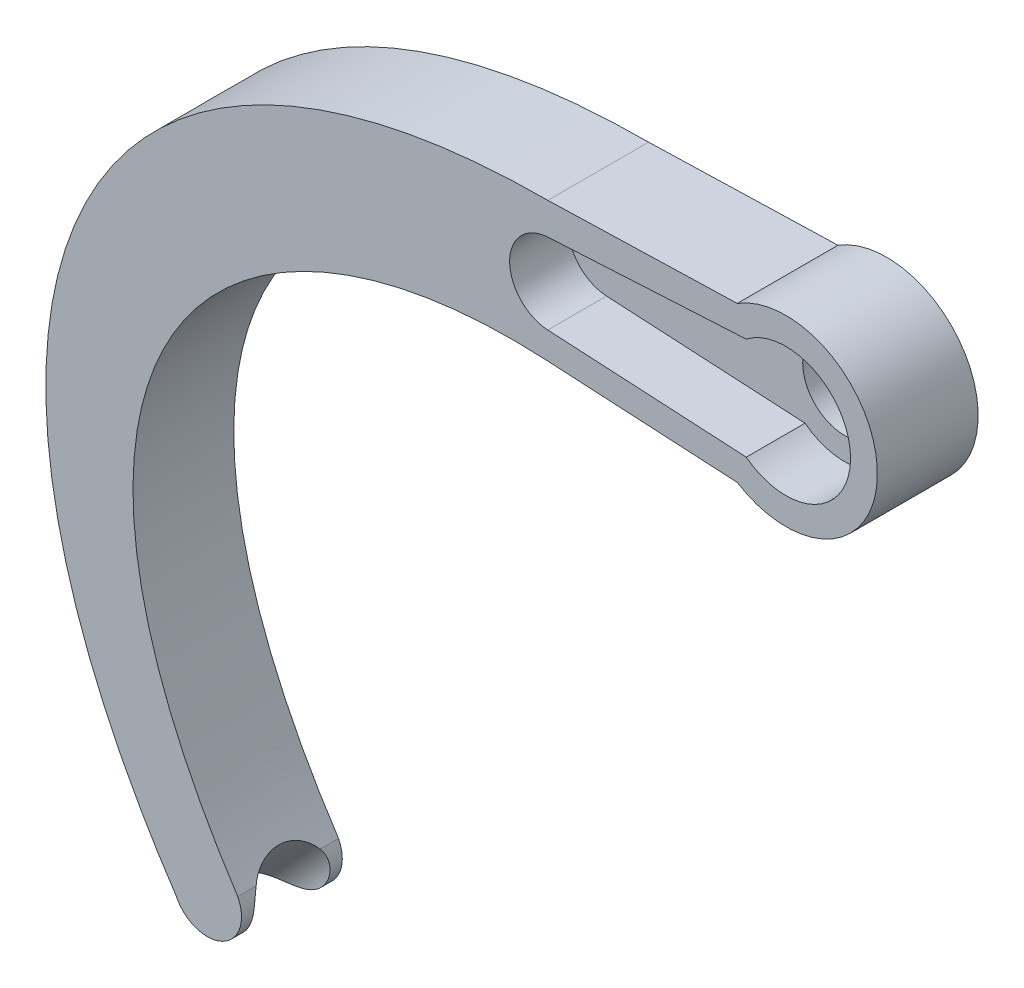
ISO-10303-21;
HEADER;
FILE_DESCRIPTION(('STEP AP214'),'2;1');
FILE_NAME('part.step','',(''),(''),'','','');
FILE_SCHEMA(('AUTOMOTIVE_DESIGN { 1 0 10303 214 1 1 1 1 }'));
ENDSEC;
DATA;
#1=APPLICATION_CONTEXT('core data for automotive mechanical design processes');
#2=APPLICATION_PROTOCOL_DEFINITION('international standard','automotive_design',2000,#1);
#3=PRODUCT_CONTEXT('',#1,'mechanical');
#4=PRODUCT('Part','Part','',(#3));
#5=PRODUCT_RELATED_PRODUCT_CATEGORY('part','',(#4));
#6=PRODUCT_DEFINITION_FORMATION('','',#4);
#7=PRODUCT_DEFINITION_CONTEXT('part definition',#1,'design');
#8=PRODUCT_DEFINITION('design','',#6,#7);
#9=PRODUCT_DEFINITION_SHAPE('','',#8);
#10=(LENGTH_UNIT() NAMED_UNIT(*) SI_UNIT(.MILLI.,.METRE.));
#11=(NAMED_UNIT(*) PLANE_ANGLE_UNIT() SI_UNIT($,.RADIAN.));
#12=(NAMED_UNIT(*) SI_UNIT($,.STERADIAN.) SOLID_ANGLE_UNIT());
#13=UNCERTAINTY_MEASURE_WITH_UNIT(LENGTH_MEASURE(1.E-05),#10,'distance_accuracy_value','');
#14=(GEOMETRIC_REPRESENTATION_CONTEXT(3) GLOBAL_UNCERTAINTY_ASSIGNED_CONTEXT((#13)) GLOBAL_UNIT_ASSIGNED_CONTEXT((#10,
#11,#12)) REPRESENTATION_CONTEXT('',''));
#15=CARTESIAN_POINT('',(0.,0.,0.));
#16=DIRECTION('',(0.,0.,1.));
#17=DIRECTION('',(1.,0.,0.));
#18=AXIS2_PLACEMENT_3D('',#15,#16,#17);
#19=CARTESIAN_POINT('',(-41.9332664034828,-10.07657373215,-80.));
#20=DIRECTION('',(0.,0.,1.));
#21=DIRECTION('',(-1.,0.,0.));
#22=AXIS2_PLACEMENT_3D('',#19,#20,#21);
#23=PLANE('',#22);
#24=DIRECTION('',(-0.999590434211399,-0.0286175441480638,0.));
#25=VECTOR('',#24,1.);
#26=CARTESIAN_POINT('',(-2.89851826531626,4.61531059254175,-80.));
#27=LINE('',#26,#25);
#28=CARTESIAN_POINT('',(-2.89851826531626,4.61531059254175,-80.));
#29=VERTEX_POINT('',#28);
#30=CARTESIAN_POINT('',(-14.1752919202389,4.29246479803185,-80.));
#31=VERTEX_POINT('',#30);
#32=EDGE_CURVE('E154',#29,#31,#27,.T.);
#33=ORIENTED_EDGE('',*,*,#32,.T.);
#34=CARTESIAN_POINT('',(-14.1752919202389,4.29246479803185,-80.));
#35=CARTESIAN_POINT('',(-42.4622601287805,4.28881821773357,-80.));
#36=CARTESIAN_POINT('',(-52.533757866495,-18.3720516921241,-80.));
#37=CARTESIAN_POINT('',(-36.3027853217966,-42.6553542320605,-80.));
#38=B_SPLINE_CURVE_WITH_KNOTS('',3,(#34,#35,#36,#37),.UNSPECIFIED.,.F.,.F.,(4,4),(0.,1.),.UNSPECIFIED.);
#39=CARTESIAN_POINT('',(-36.3027853217966,-42.6553542320605,-80.));
#40=VERTEX_POINT('',#39);
#41=EDGE_CURVE('E160',#31,#40,#38,.T.);
#42=ORIENTED_EDGE('',*,*,#41,.T.);
#43=CARTESIAN_POINT('',(-34.4577656056994,-41.7788685475317,-80.));
#44=DIRECTION('',(0.,0.,1.));
#45=DIRECTION('',(1.,0.,0.));
#46=AXIS2_PLACEMENT_3D('',#43,#44,#45);
#47=CIRCLE('',#46,2.04262696250956);
#48=CARTESIAN_POINT('',(-32.6407533174805,-40.8457065827944,-80.));
#49=VERTEX_POINT('',#48);
#50=EDGE_CURVE('E165',#40,#49,#47,.T.);
#51=ORIENTED_EDGE('',*,*,#50,.T.);
#52=CARTESIAN_POINT('',(-14.2682439340843,-3.9940417605773,-80.));
#53=CARTESIAN_POINT('',(-34.7311657897191,-2.87481631988076,-80.));
#54=CARTESIAN_POINT('',(-47.0184138672704,-18.9715456050833,-80.));
#55=CARTESIAN_POINT('',(-32.6407533174805,-40.8457065827944,-80.));
#56=B_SPLINE_CURVE_WITH_KNOTS('',3,(#52,#53,#54,#55),.UNSPECIFIED.,.F.,.F.,(4,4),(0.,1.),.UNSPECIFIED.);
#57=CARTESIAN_POINT('',(-14.2682439340843,-3.9940417605773,-80.));
#58=VERTEX_POINT('',#57);
#59=EDGE_CURVE('E186',#58,#49,#56,.T.);
#60=ORIENTED_EDGE('',*,*,#59,.F.);
#61=DIRECTION('',(0.998510440144325,-0.0545609835210728,0.));
#62=VECTOR('',#61,1.);
#63=CARTESIAN_POINT('',(-14.2682439340843,-3.9940417605773,-80.));
#64=LINE('',#63,#62);
#65=CARTESIAN_POINT('',(-2.89851826531626,-4.61531059254175,-80.));
#66=VERTEX_POINT('',#65);
#67=EDGE_CURVE('E190',#58,#66,#64,.T.);
#68=ORIENTED_EDGE('',*,*,#67,.T.);
#69=CARTESIAN_POINT('',(0.,0.,-80.));
#70=DIRECTION('',(0.,0.,1.));
#71=DIRECTION('',(1.,0.,0.));
#72=AXIS2_PLACEMENT_3D('',#69,#70,#71);
#73=CIRCLE('',#72,5.45);
#74=EDGE_CURVE('E171',#66,#29,#73,.T.);
#75=ORIENTED_EDGE('',*,*,#74,.T.);
#76=EDGE_LOOP('',(#33,#42,#51,#60,#68,#75));
#77=FACE_BOUND('',#76,.T.);
#78=DIRECTION('',(-0.998510440144325,-0.0545609835210729,0.));
#79=VECTOR('',#78,1.);
#80=CARTESIAN_POINT('',(-2.35931808461709,3.0423869207579,-80.));
#81=LINE('',#80,#79);
#82=CARTESIAN_POINT('',(-2.35931808461709,3.0423869207579,-80.));
#83=VERTEX_POINT('',#82);
#84=CARTESIAN_POINT('',(-14.1809463604506,2.39642505634638,-80.));
#85=VERTEX_POINT('',#84);
#86=EDGE_CURVE('E381',#83,#85,#81,.T.);
#87=ORIENTED_EDGE('',*,*,#86,.F.);
#88=CARTESIAN_POINT('',(0.,0.,-80.));
#89=DIRECTION('',(0.,0.,1.));
#90=DIRECTION('',(1.,0.,0.));
#91=AXIS2_PLACEMENT_3D('',#88,#89,#90);
#92=CIRCLE('',#91,3.85);
#93=CARTESIAN_POINT('',(-2.35931808461709,-3.0423869207579,-80.));
#94=VERTEX_POINT('',#93);
#95=EDGE_CURVE('E391',#94,#83,#92,.T.);
#96=ORIENTED_EDGE('',*,*,#95,.F.);
#97=DIRECTION('',(0.998510440144325,-0.0545609835210727,0.));
#98=VECTOR('',#97,1.);
#99=CARTESIAN_POINT('',(-14.1809463604506,-2.39642505634638,-80.));
#100=LINE('',#99,#98);
#101=CARTESIAN_POINT('',(-14.1809463604506,-2.39642505634638,-80.));
#102=VERTEX_POINT('',#101);
#103=EDGE_CURVE('E373',#102,#94,#100,.T.);
#104=ORIENTED_EDGE('',*,*,#103,.F.);
#105=CARTESIAN_POINT('',(-14.05,0.,-80.));
#106=DIRECTION('',(0.,0.,1.));
#107=DIRECTION('',(1.,0.,0.));
#108=AXIS2_PLACEMENT_3D('',#105,#106,#107);
#109=CIRCLE('',#108,2.4);
#110=EDGE_CURVE('E372',#85,#102,#109,.T.);
#111=ORIENTED_EDGE('',*,*,#110,.F.);
#112=EDGE_LOOP('',(#87,#96,#104,#111));
#113=FACE_BOUND('',#112,.T.);
#114=ADVANCED_FACE('F37',(#77,#113),#23,.T.);
#115=CARTESIAN_POINT('',(-2.89851826531626,4.61531059254175,-86.));
#116=DIRECTION('',(0.0286175441480638,-0.999590434211399,0.));
#117=DIRECTION('',(0.999590434211399,0.0286175441480638,0.));
#118=AXIS2_PLACEMENT_3D('',#115,#116,#117);
#119=PLANE('',#118);
#120=ORIENTED_EDGE('',*,*,#32,.F.);
#121=DIRECTION('',(0.,0.,1.));
#122=VECTOR('',#121,1.);
#123=CARTESIAN_POINT('',(-2.89851826531626,4.61531059254175,-86.));
#124=LINE('',#123,#122);
#125=CARTESIAN_POINT('',(-2.89851826531626,4.61531059254175,-86.));
#126=VERTEX_POINT('',#125);
#127=EDGE_CURVE('E196',#126,#29,#124,.T.);
#128=ORIENTED_EDGE('',*,*,#127,.F.);
#129=DIRECTION('',(-0.999590434211399,-0.0286175441480638,0.));
#130=VECTOR('',#129,1.);
#131=CARTESIAN_POINT('',(-2.89851826531626,4.61531059254175,-86.));
#132=LINE('',#131,#130);
#133=CARTESIAN_POINT('',(-14.1752919202389,4.29246479803185,-86.));
#134=VERTEX_POINT('',#133);
#135=EDGE_CURVE('E156',#126,#134,#132,.T.);
#136=ORIENTED_EDGE('',*,*,#135,.T.);
#137=DIRECTION('',(0.,0.,1.));
#138=VECTOR('',#137,1.);
#139=CARTESIAN_POINT('',(-14.1752919202389,4.29246479803185,-86.));
#140=LINE('',#139,#138);
#141=EDGE_CURVE('E51',#134,#31,#140,.T.);
#142=ORIENTED_EDGE('',*,*,#141,.T.);
#143=EDGE_LOOP('',(#120,#128,#136,#142));
#144=FACE_BOUND('',#143,.T.);
#145=ADVANCED_FACE('F39',(#144),#119,.F.);
#146=CARTESIAN_POINT('',(-14.1752919202389,4.29246479803185,-86.));
#147=CARTESIAN_POINT('',(-42.4622601287805,4.28881821773357,-86.));
#148=CARTESIAN_POINT('',(-52.533757866495,-18.3720516921241,-86.));
#149=CARTESIAN_POINT('',(-36.3027853217966,-42.6553542320605,-86.));
#150=B_SPLINE_CURVE_WITH_KNOTS('',3,(#146,#147,#148,#149),.UNSPECIFIED.,.F.,.F.,(4,4),(0.,1.),.UNSPECIFIED.);
#151=DIRECTION('',(0.,0.,1.));
#152=VECTOR('',#151,1.);
#153=SURFACE_OF_LINEAR_EXTRUSION('',#150,#152);
#154=ORIENTED_EDGE('',*,*,#41,.F.);
#155=ORIENTED_EDGE('',*,*,#141,.F.);
#156=CARTESIAN_POINT('',(-36.3027853217966,-42.6553542320605,-86.));
#157=VERTEX_POINT('',#156);
#158=EDGE_CURVE('E206',#134,#157,#150,.T.);
#159=ORIENTED_EDGE('',*,*,#158,.T.);
#160=DIRECTION('',(0.,0.,1.));
#161=VECTOR('',#160,1.);
#162=CARTESIAN_POINT('',(-36.3027853217966,-42.6553542320605,-86.));
#163=LINE('',#162,#161);
#164=EDGE_CURVE('E141',#157,#40,#163,.T.);
#165=ORIENTED_EDGE('',*,*,#164,.T.);
#166=EDGE_LOOP('',(#154,#155,#159,#165));
#167=FACE_BOUND('',#166,.T.);
#168=ADVANCED_FACE('F161',(#167),#153,.T.);
#169=CARTESIAN_POINT('',(-34.4577656056994,-41.7788685475317,-86.));
#170=DIRECTION('',(0.,0.,1.));
#171=DIRECTION('',(-1.,0.,0.));
#172=AXIS2_PLACEMENT_3D('',#169,#170,#171);
#173=CYLINDRICAL_SURFACE('',#172,2.04262696250956);
#174=DIRECTION('',(0.,0.,1.));
#175=VECTOR('',#174,1.);
#176=CARTESIAN_POINT('',(-32.6407533174805,-40.8457065827944,-86.));
#177=LINE('',#176,#175);
#178=CARTESIAN_POINT('',(-32.6407533174805,-40.8457065827944,-81.0950332622897));
#179=VERTEX_POINT('',#178);
#180=EDGE_CURVE('E132',#179,#49,#177,.T.);
#181=ORIENTED_EDGE('',*,*,#180,.T.);
#182=ORIENTED_EDGE('',*,*,#50,.F.);
#183=ORIENTED_EDGE('',*,*,#164,.F.);
#184=CARTESIAN_POINT('',(-34.4577656056994,-41.7788685475317,-86.));
#185=DIRECTION('',(0.,0.,1.));
#186=DIRECTION('',(1.,0.,0.));
#187=AXIS2_PLACEMENT_3D('',#184,#185,#186);
#188=CIRCLE('',#187,2.04262696250956);
#189=CARTESIAN_POINT('',(-32.6407533174805,-40.8457065827944,-86.));
#190=VERTEX_POINT('',#189);
#191=EDGE_CURVE('E140',#157,#190,#188,.T.);
#192=ORIENTED_EDGE('',*,*,#191,.T.);
#193=CARTESIAN_POINT('',(-32.6407533174804,-40.8457065827945,-84.9049667377105));
#194=VERTEX_POINT('',#193);
#195=EDGE_CURVE('E129',#190,#194,#177,.T.);
#196=ORIENTED_EDGE('',*,*,#195,.T.);
#197=CARTESIAN_POINT('',(-32.6407533174804,-40.8457065827945,-81.0950332622897));
#198=CARTESIAN_POINT('',(-32.6220745355062,-40.8820558724806,-81.0687277977726));
#199=CARTESIAN_POINT('',(-32.6040911412782,-40.9197782200192,-81.043820252477));
#200=CARTESIAN_POINT('',(-32.5699296706582,-40.9977151214801,-80.9968303571773));
#201=CARTESIAN_POINT('',(-32.5537515457497,-41.037929608381,-80.974747931246));
#202=CARTESIAN_POINT('',(-32.5236779395172,-41.1204237643003,-80.9335237138468));
#203=CARTESIAN_POINT('',(-32.5097730790598,-41.1626939634419,-80.9143698618984));
#204=CARTESIAN_POINT('',(-32.4845179807851,-41.2491045182225,-80.8788407191216));
#205=CARTESIAN_POINT('',(-32.4731675380123,-41.2932447234824,-80.8624652053972));
#206=CARTESIAN_POINT('',(-32.4433979741694,-41.428038739852,-80.8173192404283));
#207=CARTESIAN_POINT('',(-32.4292664084087,-41.5210504774572,-80.7925369063675));
#208=CARTESIAN_POINT('',(-32.4140933560802,-41.7100073273682,-80.7520931565649));
#209=CARTESIAN_POINT('',(-32.4130565214455,-41.8059534699949,-80.7364349840866));
#210=CARTESIAN_POINT('',(-32.4247275498036,-41.9993315275777,-80.7118652074441));
#211=CARTESIAN_POINT('',(-32.4376441069325,-42.0967639070497,-80.7030595251053));
#212=CARTESIAN_POINT('',(-32.4774439249368,-42.2890758503037,-80.6902482472002));
#213=CARTESIAN_POINT('',(-32.5043362600976,-42.3839537133242,-80.6862457758884));
#214=CARTESIAN_POINT('',(-32.57509966898,-42.5786959586113,-80.6806767172383));
#215=CARTESIAN_POINT('',(-32.6204642460473,-42.6780283208868,-80.6794121184884));
#216=CARTESIAN_POINT('',(-32.7264253508892,-42.8681998254043,-80.6780881087033));
#217=CARTESIAN_POINT('',(-32.787023204055,-42.9590382276742,-80.6780288025731));
#218=CARTESIAN_POINT('',(-32.9253414906563,-43.1342567493569,-80.677967891578));
#219=CARTESIAN_POINT('',(-33.0037741418237,-43.2180761214555,-80.6779693638535));
#220=CARTESIAN_POINT('',(-33.1735724997054,-43.3714335399114,-80.678027846176));
#221=CARTESIAN_POINT('',(-33.2649413688916,-43.4409680838885,-80.6780848698236));
#222=CARTESIAN_POINT('',(-33.4583960197149,-43.5640267860091,-80.6796049086846));
#223=CARTESIAN_POINT('',(-33.5605239882093,-43.6174844928451,-80.6810736569723));
#224=CARTESIAN_POINT('',(-33.7723113532011,-43.7064673345895,-80.6879937487977));
#225=CARTESIAN_POINT('',(-33.8819712716008,-43.7419912254047,-80.6934453685683));
#226=CARTESIAN_POINT('',(-34.0482157327862,-43.780811717667,-80.7070857005206));
#227=CARTESIAN_POINT('',(-34.1034355069909,-43.7913104977763,-80.7124731640783));
#228=CARTESIAN_POINT('',(-34.2142847405185,-43.8077038324202,-80.7254828662106));
#229=CARTESIAN_POINT('',(-34.269913974032,-43.8136007570793,-80.733103951602));
#230=CARTESIAN_POINT('',(-34.3809998100799,-43.820811116298,-80.7510121414512));
#231=CARTESIAN_POINT('',(-34.436456508161,-43.8221278523896,-80.7612973198054));
#232=CARTESIAN_POINT('',(-34.5466369734369,-43.8203044543135,-80.7849448399577));
#233=CARTESIAN_POINT('',(-34.6013608305543,-43.8171648721068,-80.7983068004929));
#234=CARTESIAN_POINT('',(-34.7043662894247,-43.8071521778731,-80.8270355745771));
#235=CARTESIAN_POINT('',(-34.7527703594427,-43.8006572677649,-80.8420963787038));
#236=CARTESIAN_POINT('',(-34.848006729531,-43.7844533783087,-80.8752232707846));
#237=CARTESIAN_POINT('',(-34.8948385120502,-43.7747433518446,-80.8932903368789));
#238=CARTESIAN_POINT('',(-34.9864338822384,-43.7524576367463,-80.9325295186581));
#239=CARTESIAN_POINT('',(-35.0311990230519,-43.7398841436929,-80.9536992509443));
#240=CARTESIAN_POINT('',(-35.1183169611923,-43.7122824623302,-80.9991826932068));
#241=CARTESIAN_POINT('',(-35.1606688604072,-43.6972533680884,-81.0234975628102));
#242=CARTESIAN_POINT('',(-35.277496837116,-43.6515607442756,-81.0972623079364));
#243=CARTESIAN_POINT('',(-35.3486853237578,-43.6184649473605,-81.1505119253282));
#244=CARTESIAN_POINT('',(-35.4804103893852,-43.5486447470524,-81.2668116093962));
#245=CARTESIAN_POINT('',(-35.540940759043,-43.5119182477686,-81.3298673490183));
#246=CARTESIAN_POINT('',(-35.655308761074,-43.4351622395027,-81.4695576277008));
#247=CARTESIAN_POINT('',(-35.7083056763219,-43.395091350914,-81.5468554375091));
#248=CARTESIAN_POINT('',(-35.8023557385352,-43.317736686436,-81.7095285193192));
#249=CARTESIAN_POINT('',(-35.84341350868,-43.2804518358797,-81.7949006476965));
#250=CARTESIAN_POINT('',(-35.9200374751139,-43.2062291506407,-81.9855995349817));
#251=CARTESIAN_POINT('',(-35.9538431257085,-43.1701907078841,-82.0919944445444));
#252=CARTESIAN_POINT('',(-35.9948583352088,-43.1242623702573,-82.2561205343697));
#253=CARTESIAN_POINT('',(-36.0069151261159,-43.1103069906349,-82.3115896480147));
#254=CARTESIAN_POINT('',(-36.0279805775476,-43.0853961377285,-82.4238292933555));
#255=CARTESIAN_POINT('',(-36.0369861685367,-43.0744436875193,-82.4806010746221));
#256=CARTESIAN_POINT('',(-36.059784553719,-43.0463378666881,-82.6536826492279));
#257=CARTESIAN_POINT('',(-36.0690519220352,-43.0343007801625,-82.7714943067186));
#258=CARTESIAN_POINT('',(-36.0761653321202,-43.0251212864623,-83.0080424864551));
#259=CARTESIAN_POINT('',(-36.074011572471,-43.0279786203145,-83.1267789925844));
#260=CARTESIAN_POINT('',(-36.0618965104243,-43.0434299115403,-83.3065677095297));
#261=CARTESIAN_POINT('',(-36.056095833202,-43.0507971209983,-83.3684183866822));
#262=CARTESIAN_POINT('',(-36.0411649830849,-43.0693404785519,-83.4910999647918));
#263=CARTESIAN_POINT('',(-36.0320375150728,-43.0805135317839,-83.5519316523401));
#264=CARTESIAN_POINT('',(-36.0103037917086,-43.1063599725711,-83.6722217795173));
#265=CARTESIAN_POINT('',(-35.9976968972214,-43.1210340031529,-83.7316799646713));
#266=CARTESIAN_POINT('',(-35.9688076639993,-43.1534771440972,-83.848852385954));
#267=CARTESIAN_POINT('',(-35.9525243455893,-43.1712470791522,-83.9065661525823));
#268=CARTESIAN_POINT('',(-35.9162559272668,-43.2091872554053,-84.0192518749902));
#269=CARTESIAN_POINT('',(-35.8963126235021,-43.2293295571905,-84.0742466801805));
#270=CARTESIAN_POINT('',(-35.8523850928273,-43.2716144941285,-84.1817774902377));
#271=CARTESIAN_POINT('',(-35.8284023407947,-43.2937563978256,-84.2343143836201));
#272=CARTESIAN_POINT('',(-35.7780097894387,-43.3378163715659,-84.332964380809));
#273=CARTESIAN_POINT('',(-35.7518922973123,-43.3596391719485,-84.379268895763));
#274=CARTESIAN_POINT('',(-35.6957912760213,-43.4039525755436,-84.4691961998889));
#275=CARTESIAN_POINT('',(-35.6658039640778,-43.4264438153807,-84.5128163025825));
#276=CARTESIAN_POINT('',(-35.5744858581311,-43.4907435191728,-84.6330413101805));
#277=CARTESIAN_POINT('',(-35.5082598687128,-43.5326438343903,-84.7059984036643));
#278=CARTESIAN_POINT('',(-35.3621382050694,-43.6122641759943,-84.8395681291875));
#279=CARTESIAN_POINT('',(-35.2822401780771,-43.6499834810433,-84.9001786326119));
#280=CARTESIAN_POINT('',(-35.1130164609566,-43.7156035194152,-85.0061390375132));
#281=CARTESIAN_POINT('',(-35.024048169081,-43.7437662729535,-85.0518943774584));
#282=CARTESIAN_POINT('',(-34.8378453787744,-43.7880994018402,-85.1305280801002));
#283=CARTESIAN_POINT('',(-34.7406134044559,-43.8042734245344,-85.1634103577463));
#284=CARTESIAN_POINT('',(-34.5502981101528,-43.8214433626216,-85.2153438892698));
#285=CARTESIAN_POINT('',(-34.4575710483966,-43.8236189472126,-85.2353374351676));
#286=CARTESIAN_POINT('',(-34.2713678575712,-43.8151085848169,-85.2675192808346));
#287=CARTESIAN_POINT('',(-34.1778915171218,-43.804418871732,-85.2797052934801));
#288=CARTESIAN_POINT('',(-33.9870084742011,-43.7690232872379,-85.2989349499275));
#289=CARTESIAN_POINT('',(-33.8897204484149,-43.7434845014914,-85.3056102976843));
#290=CARTESIAN_POINT('',(-33.6997819726218,-43.6783109898578,-85.3149224238759));
#291=CARTESIAN_POINT('',(-33.6071335382778,-43.6386701969553,-85.3175574614791));
#292=CARTESIAN_POINT('',(-33.419662773451,-43.5415081744841,-85.3209726012254));
#293=CARTESIAN_POINT('',(-33.3255576455255,-43.482590399137,-85.3215396813325));
#294=CARTESIAN_POINT('',(-33.1481240750929,-43.3503063405342,-85.3220586015861));
#295=CARTESIAN_POINT('',(-33.0647967680405,-43.2769385370036,-85.3220103769629));
#296=CARTESIAN_POINT('',(-32.9083376289744,-43.1148091736158,-85.3220134223284));
#297=CARTESIAN_POINT('',(-32.8356802782925,-43.025588865463,-85.3220683331378));
#298=CARTESIAN_POINT('',(-32.706321949199,-42.8361885564295,-85.3217166501284));
#299=CARTESIAN_POINT('',(-32.6496279810467,-42.7360037672733,-85.3213098539459));
#300=CARTESIAN_POINT('',(-32.5537698971929,-42.527419643751,-85.3181505850453));
#301=CARTESIAN_POINT('',(-32.51463318443,-42.4190077749228,-85.3153944648661));
#302=CARTESIAN_POINT('',(-32.4551842779756,-42.1973334462995,-85.3045454817761));
#303=CARTESIAN_POINT('',(-32.4348609047998,-42.084073909064,-85.2964557931415));
#304=CARTESIAN_POINT('',(-32.4189526371379,-41.9154275662223,-85.2778079395597));
#305=CARTESIAN_POINT('',(-32.4160181849771,-41.8602679683904,-85.2706652316725));
#306=CARTESIAN_POINT('',(-32.4146005634156,-41.7502877815356,-85.2538482012245));
#307=CARTESIAN_POINT('',(-32.416115016718,-41.6954670271389,-85.2441752332385));
#308=CARTESIAN_POINT('',(-32.4234646055162,-41.5867373592428,-85.2219030800915));
#309=CARTESIAN_POINT('',(-32.4292981774195,-41.5328281229809,-85.2093049550182));
#310=CARTESIAN_POINT('',(-32.4450422106987,-41.4265141484661,-85.180841013077));
#311=CARTESIAN_POINT('',(-32.4549502404827,-41.3741085327898,-85.1649771479822));
#312=CARTESIAN_POINT('',(-32.4766750226527,-41.279273480035,-85.1324335723391));
#313=CARTESIAN_POINT('',(-32.4879636567345,-41.2365495651157,-85.1162548055618));
#314=CARTESIAN_POINT('',(-32.5129243674463,-41.1529117280944,-85.0812714365308));
#315=CARTESIAN_POINT('',(-32.5265962876764,-41.1119976874427,-85.0624670065986));
#316=CARTESIAN_POINT('',(-32.5560530180107,-41.0321213751724,-85.0221081579923));
#317=CARTESIAN_POINT('',(-32.5718459776711,-40.9931674706489,-85.0005431482559));
#318=CARTESIAN_POINT('',(-32.6051250614893,-40.9176125882504,-84.954747094853));
#319=CARTESIAN_POINT('',(-32.622611416337,-40.8810119320899,-84.9305156878839));
#320=CARTESIAN_POINT('',(-32.6407533174804,-40.8457065827946,-84.9049667377103));
#321=B_SPLINE_CURVE_WITH_KNOTS('',3,(#197,#198,#199,#200,#201,#202,#203,#204,#205,#206,#207,
#208,#209,#210,#211,#212,#213,#214,#215,#216,#217,#218,#219,#220,#221,#222,#223,#224,#225,#226,
#227,#228,#229,#230,#231,#232,#233,#234,#235,#236,#237,#238,#239,#240,#241,#242,#243,#244,#245,
#246,#247,#248,#249,#250,#251,#252,#253,#254,#255,#256,#257,#258,#259,#260,#261,#262,#263,#264,
#265,#266,#267,#268,#269,#270,#271,#272,#273,#274,#275,#276,#277,#278,#279,#280,#281,#282,#283,
#284,#285,#286,#287,#288,#289,#290,#291,#292,#293,#294,#295,#296,#297,#298,#299,#300,#301,#302,
#303,#304,#305,#306,#307,#308,#309,#310,#311,#312,#313,#314,#315,#316,#317,#318,#319,#320),
.UNSPECIFIED.,.F.,.F.,(4,2,2,2,2,2,2,2,2,2,2,2,2,2,2,2,2,2,2,2,2,2,2,2,2,2,2,2,2,2,2,2,2,2,2,2,
2,2,2,2,2,2,2,2,2,2,2,2,2,2,2,2,2,2,2,2,2,2,2,2,2,4),(0.,0.145766358281533,0.291528798156644,
0.436673778110588,0.581807108102922,0.872127517188236,1.16255106036363,1.45737924229694,
1.75239909182348,2.07858438762317,2.40479807343445,2.74754690327221,3.09037966885818,
3.43461060135937,3.77886541034463,3.9480749820408,4.11719734697311,4.28619777833418,
4.45517727907083,4.60829190643422,4.76145645010641,4.91450394696879,5.06760803487979,
5.35082715317152,5.6342107304538,5.93881713256243,6.2433054247829,6.59368902271421,
6.76890993489393,6.94430660114617,7.29910991047248,7.65390705075919,7.84139708667636,
8.02873502064223,8.21610738960151,8.40352974766615,8.5889317535275,8.77426621182923,
8.94647086477887,9.11884514257453,9.43844363279611,9.75809717687675,10.0681013862676,
10.3780112439561,10.6614193850928,10.9449105093483,11.2460898979095,11.5473990179469,
11.8789879966711,12.2106118802386,12.5541630011611,12.8978647567975,13.2421011031982,
13.5861327618641,13.7530325834831,13.9198432375015,14.0865935328132,14.2532444574576,
14.3942581535202,14.5352625992376,14.6768252052058,14.8184071233406),.UNSPECIFIED.);
#322=EDGE_CURVE('E133',#179,#194,#321,.T.);
#323=ORIENTED_EDGE('',*,*,#322,.F.);
#324=EDGE_LOOP('',(#181,#182,#183,#192,#196,#323));
#325=FACE_BOUND('',#324,.T.);
#326=ADVANCED_FACE('F138',(#325),#173,.T.);
#327=CARTESIAN_POINT('',(-14.2682439340843,-3.9940417605773,-86.));
#328=CARTESIAN_POINT('',(-34.7311657897191,-2.87481631988076,-86.));
#329=CARTESIAN_POINT('',(-47.0184138672704,-18.9715456050833,-86.));
#330=CARTESIAN_POINT('',(-32.6407533174805,-40.8457065827944,-86.));
#331=B_SPLINE_CURVE_WITH_KNOTS('',3,(#327,#328,#329,#330),.UNSPECIFIED.,.F.,.F.,(4,4),(0.,1.),.UNSPECIFIED.);
#332=DIRECTION('',(0.,0.,1.));
#333=VECTOR('',#332,1.);
#334=SURFACE_OF_LINEAR_EXTRUSION('',#331,#333);
#335=CARTESIAN_POINT('',(-32.6407533174804,-40.8457065827945,-81.0950332622897));
#336=CARTESIAN_POINT('',(-32.6707717794153,-40.8000374671283,-81.1313258912622));
#337=CARTESIAN_POINT('',(-32.6999187418871,-40.7555407018418,-81.169822134925));
#338=CARTESIAN_POINT('',(-32.7563022274618,-40.669200163097,-81.2510120709212));
#339=CARTESIAN_POINT('',(-32.783537834231,-40.6273576630459,-81.2937077532919));
#340=CARTESIAN_POINT('',(-32.8359061042891,-40.5466721041824,-81.3830583895174));
#341=CARTESIAN_POINT('',(-32.8610384561357,-40.5078294896474,-81.4297139276803));
#342=CARTESIAN_POINT('',(-32.9090133525323,-40.4334871657255,-81.5266855780596));
#343=CARTESIAN_POINT('',(-32.9318568304473,-40.3979860940733,-81.5770001836046));
#344=CARTESIAN_POINT('',(-32.9745612114682,-40.3314607152494,-81.6797033819652));
#345=CARTESIAN_POINT('',(-32.994482438364,-40.3003466234169,-81.7320085871687));
#346=CARTESIAN_POINT('',(-33.0318790989632,-40.2418177924835,-81.8395467061147));
#347=CARTESIAN_POINT('',(-33.0493519265236,-40.214406996367,-81.8947826545155));
#348=CARTESIAN_POINT('',(-33.0976104692377,-40.1385671056776,-82.0634121430211));
#349=CARTESIAN_POINT('',(-33.1246040136865,-40.0959558657306,-82.1806128405096));
#350=CARTESIAN_POINT('',(-33.1674837011866,-40.0281364447919,-82.4218755578821));
#351=CARTESIAN_POINT('',(-33.1833728609801,-40.0029235371967,-82.5459357043599));
#352=CARTESIAN_POINT('',(-33.1984003765217,-39.9790631511722,-82.7329844935055));
#353=CARTESIAN_POINT('',(-33.2019491110799,-39.9734248081233,-82.794822358594));
#354=CARTESIAN_POINT('',(-33.206249435844,-39.9665915433258,-82.9188022814641));
#355=CARTESIAN_POINT('',(-33.2070034468932,-39.9653927759319,-82.9809440292655));
#356=CARTESIAN_POINT('',(-33.2057211158691,-39.9674307904694,-83.1041690581664));
#357=CARTESIAN_POINT('',(-33.2037273264176,-39.9705999307366,-83.1652539758451));
#358=CARTESIAN_POINT('',(-33.1970416039768,-39.9812207781195,-83.2869019634945));
#359=CARTESIAN_POINT('',(-33.1923496534616,-39.9886725130526,-83.3474650300729));
#360=CARTESIAN_POINT('',(-33.180305267606,-40.0077843405542,-83.4676289491494));
#361=CARTESIAN_POINT('',(-33.1729540662719,-40.0194424811636,-83.5272302345766));
#362=CARTESIAN_POINT('',(-33.1556452999691,-40.046858902899,-83.6451300115797));
#363=CARTESIAN_POINT('',(-33.1456857386026,-40.0626203245565,-83.7034274679682));
#364=CARTESIAN_POINT('',(-33.1117163140888,-40.1162988449354,-83.8771864840449));
#365=CARTESIAN_POINT('',(-33.0837618495907,-40.1603770252344,-83.9900591777763));
#366=CARTESIAN_POINT('',(-33.0182329328003,-40.2632392644667,-84.2058837545016));
#367=CARTESIAN_POINT('',(-32.9806553361128,-40.3220281300289,-84.3088323796051));
#368=CARTESIAN_POINT('',(-32.9181317544818,-40.4193176942957,-84.4533979211391));
#369=CARTESIAN_POINT('',(-32.8963992200513,-40.4530571036623,-84.4997173981262));
#370=CARTESIAN_POINT('',(-32.8509954672815,-40.5233539628618,-84.589072872178));
#371=CARTESIAN_POINT('',(-32.8273265535772,-40.5599080597549,-84.6321126580796));
#372=CARTESIAN_POINT('',(-32.7775667671874,-40.6365342154443,-84.7157554877758));
#373=CARTESIAN_POINT('',(-32.7514305794132,-40.6766707748459,-84.7562723300442));
#374=CARTESIAN_POINT('',(-32.6973810470962,-40.7594144532318,-84.8335223466717));
#375=CARTESIAN_POINT('',(-32.6694658971984,-40.8020240779301,-84.8702515750083));
#376=CARTESIAN_POINT('',(-32.6407533174805,-40.8457065827944,-84.9049667377104));
#377=B_SPLINE_CURVE_WITH_KNOTS('',3,(#335,#336,#337,#338,#339,#340,#341,#342,#343,#344,#345,
#346,#347,#348,#349,#350,#351,#352,#353,#354,#355,#356,#357,#358,#359,#360,#361,#362,#363,#364,
#365,#366,#367,#368,#369,#370,#371,#372,#373,#374,#375,#376),.UNSPECIFIED.,.F.,.F.,(4,2,2,2,2,2,
2,2,2,2,2,2,2,2,2,2,2,2,2,2,4),(0.,0.196766592295478,0.393626882088922,0.590516270840182,
0.787325041757333,0.979209679194274,1.1712970370837,1.55216004275633,1.93291953863023,
2.11932201108645,2.30556298034606,2.4889519911002,2.67234219306158,2.85564740303401,
3.0390933240406,3.41037487910411,3.78177790697811,3.96548771691041,4.14898197464843,
4.33699871739656,4.52520940231183),.UNSPECIFIED.);
#378=EDGE_CURVE('E11',#179,#194,#377,.T.);
#379=ORIENTED_EDGE('',*,*,#378,.T.);
#380=ORIENTED_EDGE('',*,*,#195,.F.);
#381=CARTESIAN_POINT('',(-14.2682439340843,-3.9940417605773,-86.));
#382=VERTEX_POINT('',#381);
#383=EDGE_CURVE('E204',#382,#190,#331,.T.);
#384=ORIENTED_EDGE('',*,*,#383,.F.);
#385=DIRECTION('',(0.,0.,1.));
#386=VECTOR('',#385,1.);
#387=CARTESIAN_POINT('',(-14.2682439340843,-3.9940417605773,-86.));
#388=LINE('',#387,#386);
#389=EDGE_CURVE('E144',#382,#58,#388,.T.);
#390=ORIENTED_EDGE('',*,*,#389,.T.);
#391=ORIENTED_EDGE('',*,*,#59,.T.);
#392=ORIENTED_EDGE('',*,*,#180,.F.);
#393=EDGE_LOOP('',(#379,#380,#384,#390,#391,#392));
#394=FACE_BOUND('',#393,.T.);
#395=ADVANCED_FACE('F126',(#394),#334,.F.);
#396=CARTESIAN_POINT('',(-14.2682439340843,-3.9940417605773,-86.));
#397=DIRECTION('',(0.0545609835210728,0.998510440144325,0.));
#398=DIRECTION('',(-0.998510440144325,0.0545609835210728,0.));
#399=AXIS2_PLACEMENT_3D('',#396,#397,#398);
#400=PLANE('',#399);
#401=ORIENTED_EDGE('',*,*,#67,.F.);
#402=ORIENTED_EDGE('',*,*,#389,.F.);
#403=DIRECTION('',(0.998510440144325,-0.0545609835210728,0.));
#404=VECTOR('',#403,1.);
#405=CARTESIAN_POINT('',(-14.2682439340843,-3.9940417605773,-86.));
#406=LINE('',#405,#404);
#407=CARTESIAN_POINT('',(-2.89851826531626,-4.61531059254175,-86.));
#408=VERTEX_POINT('',#407);
#409=EDGE_CURVE('E361',#382,#408,#406,.T.);
#410=ORIENTED_EDGE('',*,*,#409,.T.);
#411=DIRECTION('',(0.,0.,1.));
#412=VECTOR('',#411,1.);
#413=CARTESIAN_POINT('',(-2.89851826531626,-4.61531059254175,-86.));
#414=LINE('',#413,#412);
#415=EDGE_CURVE('E197',#408,#66,#414,.T.);
#416=ORIENTED_EDGE('',*,*,#415,.T.);
#417=EDGE_LOOP('',(#401,#402,#410,#416));
#418=FACE_BOUND('',#417,.T.);
#419=ADVANCED_FACE('F205',(#418),#400,.F.);
#420=CARTESIAN_POINT('',(0.,0.,-86.));
#421=DIRECTION('',(0.,0.,1.));
#422=DIRECTION('',(-1.,0.,0.));
#423=AXIS2_PLACEMENT_3D('',#420,#421,#422);
#424=CYLINDRICAL_SURFACE('',#423,5.45);
#425=ORIENTED_EDGE('',*,*,#74,.F.);
#426=ORIENTED_EDGE('',*,*,#415,.F.);
#427=CARTESIAN_POINT('',(0.,0.,-86.));
#428=DIRECTION('',(0.,0.,1.));
#429=DIRECTION('',(1.,0.,0.));
#430=AXIS2_PLACEMENT_3D('',#427,#428,#429);
#431=CIRCLE('',#430,5.45);
#432=EDGE_CURVE('E177',#408,#126,#431,.T.);
#433=ORIENTED_EDGE('',*,*,#432,.T.);
#434=ORIENTED_EDGE('',*,*,#127,.T.);
#435=EDGE_LOOP('',(#425,#426,#433,#434));
#436=FACE_BOUND('',#435,.T.);
#437=ADVANCED_FACE('F262',(#436),#424,.T.);
#438=CARTESIAN_POINT('',(-41.9332664034828,-10.07657373215,-86.));
#439=DIRECTION('',(0.,0.,1.));
#440=DIRECTION('',(-1.,0.,0.));
#441=AXIS2_PLACEMENT_3D('',#438,#439,#440);
#442=PLANE('',#441);
#443=CARTESIAN_POINT('',(0.,0.,-86.));
#444=DIRECTION('',(0.,0.,-1.));
#445=DIRECTION('',(-1.,0.,0.));
#446=AXIS2_PLACEMENT_3D('',#443,#444,#445);
#447=CIRCLE('',#446,2.5);
#448=CARTESIAN_POINT('',(-2.5,0.,-86.));
#449=VERTEX_POINT('',#448);
#450=EDGE_CURVE('E370',#449,#449,#447,.T.);
#451=ORIENTED_EDGE('',*,*,#450,.F.);
#452=EDGE_LOOP('',(#451));
#453=FACE_BOUND('',#452,.T.);
#454=ORIENTED_EDGE('',*,*,#135,.F.);
#455=ORIENTED_EDGE('',*,*,#432,.F.);
#456=ORIENTED_EDGE('',*,*,#409,.F.);
#457=ORIENTED_EDGE('',*,*,#383,.T.);
#458=ORIENTED_EDGE('',*,*,#191,.F.);
#459=ORIENTED_EDGE('',*,*,#158,.F.);
#460=EDGE_LOOP('',(#454,#455,#456,#457,#458,#459));
#461=FACE_BOUND('',#460,.T.);
#462=ADVANCED_FACE('F259',(#453,#461),#442,.F.);
#463=CARTESIAN_POINT('',(-14.05,0.,-83.5));
#464=DIRECTION('',(0.,0.,1.));
#465=DIRECTION('',(-1.,0.,0.));
#466=AXIS2_PLACEMENT_3D('',#463,#464,#465);
#467=CYLINDRICAL_SURFACE('',#466,2.4);
#468=ORIENTED_EDGE('',*,*,#110,.T.);
#469=DIRECTION('',(0.,0.,1.));
#470=VECTOR('',#469,1.);
#471=CARTESIAN_POINT('',(-14.1809463604506,-2.39642505634638,-83.5));
#472=LINE('',#471,#470);
#473=CARTESIAN_POINT('',(-14.1809463604506,-2.39642505634638,-83.5));
#474=VERTEX_POINT('',#473);
#475=EDGE_CURVE('E172',#474,#102,#472,.T.);
#476=ORIENTED_EDGE('',*,*,#475,.F.);
#477=CARTESIAN_POINT('',(-14.05,0.,-83.5));
#478=DIRECTION('',(0.,0.,1.));
#479=DIRECTION('',(1.,0.,0.));
#480=AXIS2_PLACEMENT_3D('',#477,#478,#479);
#481=CIRCLE('',#480,2.4);
#482=CARTESIAN_POINT('',(-14.1809463604506,2.39642505634638,-83.5));
#483=VERTEX_POINT('',#482);
#484=EDGE_CURVE('E377',#483,#474,#481,.T.);
#485=ORIENTED_EDGE('',*,*,#484,.F.);
#486=DIRECTION('',(0.,0.,1.));
#487=VECTOR('',#486,1.);
#488=CARTESIAN_POINT('',(-14.1809463604506,2.39642505634638,-83.5));
#489=LINE('',#488,#487);
#490=EDGE_CURVE('E63',#483,#85,#489,.T.);
#491=ORIENTED_EDGE('',*,*,#490,.T.);
#492=EDGE_LOOP('',(#468,#476,#485,#491));
#493=FACE_BOUND('',#492,.T.);
#494=ADVANCED_FACE('F255',(#493),#467,.F.);
#495=CARTESIAN_POINT('',(-14.1809463604506,-2.39642505634638,-83.5));
#496=DIRECTION('',(0.0545609835210727,0.998510440144325,0.));
#497=DIRECTION('',(-0.998510440144325,0.0545609835210727,0.));
#498=AXIS2_PLACEMENT_3D('',#495,#496,#497);
#499=PLANE('',#498);
#500=ORIENTED_EDGE('',*,*,#103,.T.);
#501=DIRECTION('',(0.,0.,1.));
#502=VECTOR('',#501,1.);
#503=CARTESIAN_POINT('',(-2.35931808461709,-3.0423869207579,-83.5));
#504=LINE('',#503,#502);
#505=CARTESIAN_POINT('',(-2.35931808461709,-3.0423869207579,-83.5));
#506=VERTEX_POINT('',#505);
#507=EDGE_CURVE('E174',#506,#94,#504,.T.);
#508=ORIENTED_EDGE('',*,*,#507,.F.);
#509=DIRECTION('',(0.998510440144325,-0.0545609835210727,0.));
#510=VECTOR('',#509,1.);
#511=CARTESIAN_POINT('',(-14.1809463604506,-2.39642505634638,-83.5));
#512=LINE('',#511,#510);
#513=EDGE_CURVE('E380',#474,#506,#512,.T.);
#514=ORIENTED_EDGE('',*,*,#513,.F.);
#515=ORIENTED_EDGE('',*,*,#475,.T.);
#516=EDGE_LOOP('',(#500,#508,#514,#515));
#517=FACE_BOUND('',#516,.T.);
#518=ADVANCED_FACE('F251',(#517),#499,.T.);
#519=CARTESIAN_POINT('',(0.,0.,-83.5));
#520=DIRECTION('',(0.,0.,1.));
#521=DIRECTION('',(-1.,0.,0.));
#522=AXIS2_PLACEMENT_3D('',#519,#520,#521);
#523=CYLINDRICAL_SURFACE('',#522,3.85);
#524=ORIENTED_EDGE('',*,*,#95,.T.);
#525=DIRECTION('',(0.,0.,1.));
#526=VECTOR('',#525,1.);
#527=CARTESIAN_POINT('',(-2.35931808461709,3.0423869207579,-83.5));
#528=LINE('',#527,#526);
#529=CARTESIAN_POINT('',(-2.35931808461709,3.0423869207579,-83.5));
#530=VERTEX_POINT('',#529);
#531=EDGE_CURVE('E397',#530,#83,#528,.T.);
#532=ORIENTED_EDGE('',*,*,#531,.F.);
#533=CARTESIAN_POINT('',(0.,0.,-83.5));
#534=DIRECTION('',(0.,0.,1.));
#535=DIRECTION('',(1.,0.,0.));
#536=AXIS2_PLACEMENT_3D('',#533,#534,#535);
#537=CIRCLE('',#536,3.85);
#538=EDGE_CURVE('E384',#506,#530,#537,.T.);
#539=ORIENTED_EDGE('',*,*,#538,.F.);
#540=ORIENTED_EDGE('',*,*,#507,.T.);
#541=EDGE_LOOP('',(#524,#532,#539,#540));
#542=FACE_BOUND('',#541,.T.);
#543=ADVANCED_FACE('F247',(#542),#523,.F.);
#544=CARTESIAN_POINT('',(-2.35931808461709,3.0423869207579,-83.5));
#545=DIRECTION('',(0.0545609835210729,-0.998510440144325,0.));
#546=DIRECTION('',(0.998510440144325,0.0545609835210729,0.));
#547=AXIS2_PLACEMENT_3D('',#544,#545,#546);
#548=PLANE('',#547);
#549=ORIENTED_EDGE('',*,*,#86,.T.);
#550=ORIENTED_EDGE('',*,*,#490,.F.);
#551=DIRECTION('',(-0.998510440144325,-0.0545609835210729,0.));
#552=VECTOR('',#551,1.);
#553=CARTESIAN_POINT('',(-2.35931808461709,3.0423869207579,-83.5));
#554=LINE('',#553,#552);
#555=EDGE_CURVE('E387',#530,#483,#554,.T.);
#556=ORIENTED_EDGE('',*,*,#555,.F.);
#557=ORIENTED_EDGE('',*,*,#531,.T.);
#558=EDGE_LOOP('',(#549,#550,#556,#557));
#559=FACE_BOUND('',#558,.T.);
#560=ADVANCED_FACE('F243',(#559),#548,.T.);
#561=CARTESIAN_POINT('',(-14.05,0.,-83.5));
#562=DIRECTION('',(0.,0.,-1.));
#563=DIRECTION('',(1.,0.,0.));
#564=AXIS2_PLACEMENT_3D('',#561,#562,#563);
#565=PLANE('',#564);
#566=CARTESIAN_POINT('',(0.,0.,-83.5));
#567=DIRECTION('',(0.,0.,-1.));
#568=DIRECTION('',(-1.,0.,0.));
#569=AXIS2_PLACEMENT_3D('',#566,#567,#568);
#570=CIRCLE('',#569,2.5);
#571=CARTESIAN_POINT('',(-2.5,0.,-83.5));
#572=VERTEX_POINT('',#571);
#573=EDGE_CURVE('E136',#572,#572,#570,.T.);
#574=ORIENTED_EDGE('',*,*,#573,.T.);
#575=EDGE_LOOP('',(#574));
#576=FACE_BOUND('',#575,.T.);
#577=ORIENTED_EDGE('',*,*,#484,.T.);
#578=ORIENTED_EDGE('',*,*,#513,.T.);
#579=ORIENTED_EDGE('',*,*,#538,.T.);
#580=ORIENTED_EDGE('',*,*,#555,.T.);
#581=EDGE_LOOP('',(#577,#578,#579,#580));
#582=FACE_BOUND('',#581,.T.);
#583=ADVANCED_FACE('F239',(#576,#582),#565,.F.);
#584=CARTESIAN_POINT('',(0.,0.,-87.));
#585=DIRECTION('',(0.,0.,1.));
#586=DIRECTION('',(-1.,0.,0.));
#587=AXIS2_PLACEMENT_3D('',#584,#585,#586);
#588=CYLINDRICAL_SURFACE('',#587,2.5);
#589=ORIENTED_EDGE('',*,*,#573,.F.);
#590=EDGE_LOOP('',(#589));
#591=FACE_BOUND('',#590,.T.);
#592=ORIENTED_EDGE('',*,*,#450,.T.);
#593=EDGE_LOOP('',(#592));
#594=FACE_BOUND('',#593,.T.);
#595=ADVANCED_FACE('F235',(#591,#594),#588,.F.);
#596=CARTESIAN_POINT('',(-40.1465706992351,-50.840106520313,-83.));
#597=DIRECTION('',(-0.68362627730485,-0.729832249889187,0.));
#598=DIRECTION('',(0.729832249889187,-0.68362627730485,0.));
#599=AXIS2_PLACEMENT_3D('',#596,#597,#598);
#600=ELLIPSE('',#599,2.36875334294071,2.3220118833595);
#601=DIRECTION('',(0.68362627730485,0.729832249889187,0.));
#602=VECTOR('',#601,1.);
#603=SURFACE_OF_LINEAR_EXTRUSION('',#600,#602);
#604=ORIENTED_EDGE('',*,*,#378,.F.);
#605=ORIENTED_EDGE('',*,*,#322,.T.);
#606=EDGE_LOOP('',(#604,#605));
#607=FACE_BOUND('',#606,.T.);
#608=ADVANCED_FACE('F134',(#607),#603,.T.);
#609=CLOSED_SHELL('',(#114,#145,#168,#326,#395,#419,#437,#462,#494,#518,#543,#560,#583,#595,#608));
#610=MANIFOLD_SOLID_BREP('B2',#609);
#611=ADVANCED_BREP_SHAPE_REPRESENTATION('',(#18,#610),#14);
#612=SHAPE_DEFINITION_REPRESENTATION(#9,#611);
ENDSEC;
END-ISO-10303-21;
